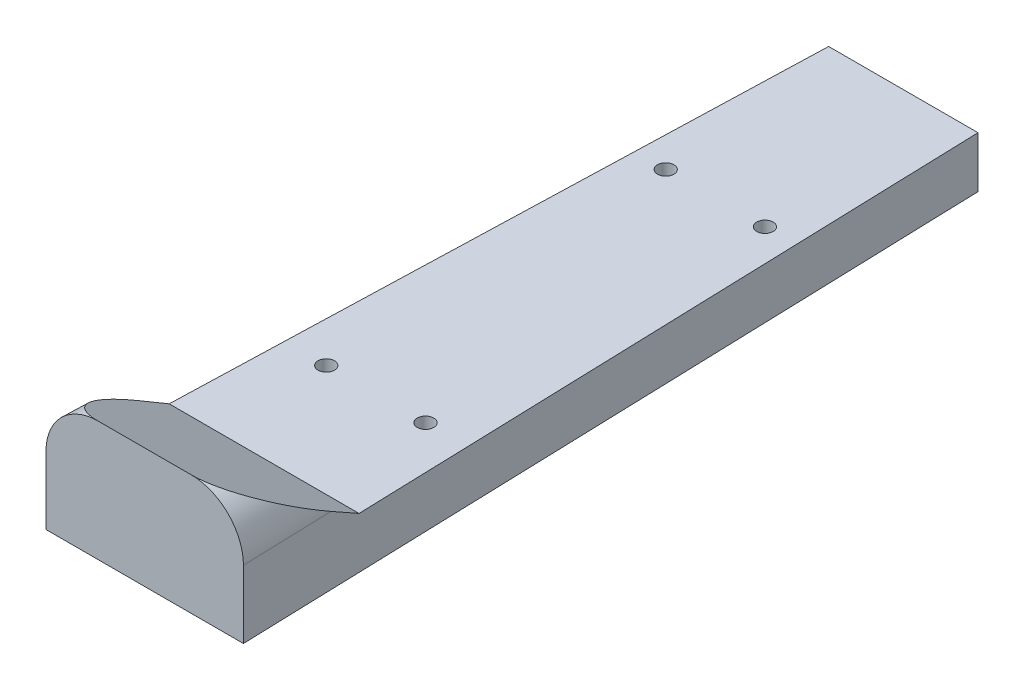
ISO-10303-21;
HEADER;
FILE_DESCRIPTION(('STEP AP214'),'2;1');
FILE_NAME('part.step','',(''),(''),'','','');
FILE_SCHEMA(('AUTOMOTIVE_DESIGN { 1 0 10303 214 1 1 1 1 }'));
ENDSEC;
DATA;
#1=APPLICATION_CONTEXT('core data for automotive mechanical design processes');
#2=APPLICATION_PROTOCOL_DEFINITION('international standard','automotive_design',2000,#1);
#3=PRODUCT_CONTEXT('',#1,'mechanical');
#4=PRODUCT('Part','Part','',(#3));
#5=PRODUCT_RELATED_PRODUCT_CATEGORY('part','',(#4));
#6=PRODUCT_DEFINITION_FORMATION('','',#4);
#7=PRODUCT_DEFINITION_CONTEXT('part definition',#1,'design');
#8=PRODUCT_DEFINITION('design','',#6,#7);
#9=PRODUCT_DEFINITION_SHAPE('','',#8);
#10=(LENGTH_UNIT() NAMED_UNIT(*) SI_UNIT(.MILLI.,.METRE.));
#11=(NAMED_UNIT(*) PLANE_ANGLE_UNIT() SI_UNIT($,.RADIAN.));
#12=(NAMED_UNIT(*) SI_UNIT($,.STERADIAN.) SOLID_ANGLE_UNIT());
#13=UNCERTAINTY_MEASURE_WITH_UNIT(LENGTH_MEASURE(1.E-05),#10,'distance_accuracy_value','');
#14=(GEOMETRIC_REPRESENTATION_CONTEXT(3) GLOBAL_UNCERTAINTY_ASSIGNED_CONTEXT((#13)) GLOBAL_UNIT_ASSIGNED_CONTEXT((#10,
#11,#12)) REPRESENTATION_CONTEXT('',''));
#15=CARTESIAN_POINT('',(0.,0.,0.));
#16=DIRECTION('',(0.,0.,1.));
#17=DIRECTION('',(1.,0.,0.));
#18=AXIS2_PLACEMENT_3D('',#15,#16,#17);
#19=CARTESIAN_POINT('',(0.,20.723241317766,0.));
#20=DIRECTION('',(0.,1.,0.));
#21=DIRECTION('',(0.,0.,1.));
#22=AXIS2_PLACEMENT_3D('',#19,#20,#21);
#23=PLANE('',#22);
#24=CARTESIAN_POINT('',(-12.065,20.723241317766,-1311.9354));
#25=DIRECTION('',(0.,1.,0.));
#26=DIRECTION('',(0.,0.,1.));
#27=AXIS2_PLACEMENT_3D('',#24,#25,#26);
#28=CIRCLE('',#27,2.);
#29=CARTESIAN_POINT('',(-12.065,20.723241317766,-1309.9354));
#30=VERTEX_POINT('',#29);
#31=EDGE_CURVE('E152',#30,#30,#28,.F.);
#32=ORIENTED_EDGE('',*,*,#31,.F.);
#33=EDGE_LOOP('',(#32));
#34=FACE_BOUND('',#33,.T.);
#35=CARTESIAN_POINT('',(-12.065,20.723241317766,-1229.3854));
#36=DIRECTION('',(0.,1.,0.));
#37=DIRECTION('',(0.,0.,1.));
#38=AXIS2_PLACEMENT_3D('',#35,#36,#37);
#39=CIRCLE('',#38,2.);
#40=CARTESIAN_POINT('',(-12.065,20.723241317766,-1227.3854));
#41=VERTEX_POINT('',#40);
#42=EDGE_CURVE('E148',#41,#41,#39,.F.);
#43=ORIENTED_EDGE('',*,*,#42,.F.);
#44=EDGE_LOOP('',(#43));
#45=FACE_BOUND('',#44,.T.);
#46=CARTESIAN_POINT('',(12.065,20.723241317766,-1311.9354));
#47=DIRECTION('',(0.,1.,0.));
#48=DIRECTION('',(0.,0.,1.));
#49=AXIS2_PLACEMENT_3D('',#46,#47,#48);
#50=CIRCLE('',#49,2.);
#51=CARTESIAN_POINT('',(12.065,20.723241317766,-1309.9354));
#52=VERTEX_POINT('',#51);
#53=EDGE_CURVE('E145',#52,#52,#50,.F.);
#54=ORIENTED_EDGE('',*,*,#53,.F.);
#55=EDGE_LOOP('',(#54));
#56=FACE_BOUND('',#55,.T.);
#57=CARTESIAN_POINT('',(12.065,20.723241317766,-1229.3854));
#58=DIRECTION('',(0.,1.,0.));
#59=DIRECTION('',(0.,0.,1.));
#60=AXIS2_PLACEMENT_3D('',#57,#58,#59);
#61=CIRCLE('',#60,2.);
#62=CARTESIAN_POINT('',(12.065,20.723241317766,-1227.3854));
#63=VERTEX_POINT('',#62);
#64=EDGE_CURVE('E164',#63,#63,#61,.F.);
#65=ORIENTED_EDGE('',*,*,#64,.F.);
#66=EDGE_LOOP('',(#65));
#67=FACE_BOUND('',#66,.T.);
#68=DIRECTION('',(-1.,0.,0.));
#69=VECTOR('',#68,1.);
#70=CARTESIAN_POINT('',(0.,20.723241317766,-1173.17130026192));
#71=LINE('',#70,#69);
#72=CARTESIAN_POINT('',(24.0069483527925,20.723241317766,-1173.17130026192));
#73=VERTEX_POINT('',#72);
#74=CARTESIAN_POINT('',(-24.0069483527925,20.723241317766,-1173.17130026192));
#75=VERTEX_POINT('',#74);
#76=EDGE_CURVE('E11',#73,#75,#71,.T.);
#77=ORIENTED_EDGE('',*,*,#76,.T.);
#78=DIRECTION('',(-0.0316721902279268,0.,0.999498310336824));
#79=VECTOR('',#78,1.);
#80=CARTESIAN_POINT('',(-61.1211296763861,20.723241317766,-1.93681172447797));
#81=LINE('',#80,#79);
#82=CARTESIAN_POINT('',(-18.161,20.723241317766,-1357.6554));
#83=VERTEX_POINT('',#82);
#84=EDGE_CURVE('E149',#83,#75,#81,.T.);
#85=ORIENTED_EDGE('',*,*,#84,.F.);
#86=DIRECTION('',(-1.,0.,0.));
#87=VECTOR('',#86,1.);
#88=CARTESIAN_POINT('',(0.,20.723241317766,-1357.6554));
#89=LINE('',#88,#87);
#90=CARTESIAN_POINT('',(18.161,20.723241317766,-1357.6554));
#91=VERTEX_POINT('',#90);
#92=EDGE_CURVE('E53',#91,#83,#89,.T.);
#93=ORIENTED_EDGE('',*,*,#92,.F.);
#94=DIRECTION('',(-0.0316721902279269,0.,-0.999498310336824));
#95=VECTOR('',#94,1.);
#96=CARTESIAN_POINT('',(61.1211296763861,20.723241317766,-1.93681172447798));
#97=LINE('',#96,#95);
#98=EDGE_CURVE('E59',#73,#91,#97,.T.);
#99=ORIENTED_EDGE('',*,*,#98,.F.);
#100=EDGE_LOOP('',(#77,#85,#93,#99));
#101=FACE_BOUND('',#100,.T.);
#102=ADVANCED_FACE('F45',(#34,#45,#56,#67,#101),#23,.F.);
#103=CARTESIAN_POINT('',(48.4275011351085,37.211,-1.5345749085833));
#104=DIRECTION('',(0.0316721902279269,0.,0.999498310336824));
#105=DIRECTION('',(0.999498310336824,0.,-0.0316721902279269));
#106=AXIS2_PLACEMENT_3D('',#103,#104,#105);
#107=CYLINDRICAL_SURFACE('',#106,12.7);
#108=CARTESIAN_POINT('',(10.6035293942455,37.211,-1195.16834551804));
#109=DIRECTION('',(0.,-0.866025403784437,0.500000000000002));
#110=DIRECTION('',(0.0365657822610186,0.49966562408466,0.865446247710236));
#111=AXIS2_PLACEMENT_3D('',#108,#109,#110);
#112=ELLIPSE('',#111,25.4127493136434,12.7);
#113=CARTESIAN_POINT('',(11.3005736959707,49.911,-1173.17130026192));
#114=VERTEX_POINT('',#113);
#115=CARTESIAN_POINT('',(23.3099040510673,37.211,-1195.16834551804));
#116=VERTEX_POINT('',#115);
#117=EDGE_CURVE('E225',#114,#116,#112,.F.);
#118=ORIENTED_EDGE('',*,*,#117,.F.);
#119=CARTESIAN_POINT('',(11.3005736959708,37.211,-1173.17130026192));
#120=DIRECTION('',(0.,0.,1.));
#121=DIRECTION('',(1.,0.,0.));
#122=AXIS2_PLACEMENT_3D('',#119,#120,#121);
#123=ELLIPSE('',#122,12.7063746568218,12.7);
#124=CARTESIAN_POINT('',(24.0069483527925,37.211,-1173.17130026192));
#125=VERTEX_POINT('',#124);
#126=EDGE_CURVE('E122',#114,#125,#123,.F.);
#127=ORIENTED_EDGE('',*,*,#126,.T.);
#128=DIRECTION('',(0.0316721902279269,0.,0.999498310336824));
#129=VECTOR('',#128,1.);
#130=CARTESIAN_POINT('',(61.1211296763861,37.211,-1.93681172447798));
#131=LINE('',#130,#129);
#132=EDGE_CURVE('E139',#116,#125,#131,.T.);
#133=ORIENTED_EDGE('',*,*,#132,.F.);
#134=EDGE_LOOP('',(#118,#127,#133));
#135=FACE_BOUND('',#134,.T.);
#136=ADVANCED_FACE('F176',(#135),#107,.T.);
#137=CARTESIAN_POINT('',(-127.,33.147,-1367.43782063533));
#138=DIRECTION('',(0.,-1.,0.));
#139=DIRECTION('',(0.,0.,-1.));
#140=AXIS2_PLACEMENT_3D('',#137,#138,#139);
#141=PLANE('',#140);
#142=CARTESIAN_POINT('',(12.065,33.147,-1311.9354));
#143=DIRECTION('',(0.,1.,0.));
#144=DIRECTION('',(0.,0.,-1.));
#145=AXIS2_PLACEMENT_3D('',#142,#143,#144);
#146=CIRCLE('',#145,2.);
#147=CARTESIAN_POINT('',(12.065,33.147,-1313.9354));
#148=VERTEX_POINT('',#147);
#149=EDGE_CURVE('E338',#148,#148,#146,.T.);
#150=ORIENTED_EDGE('',*,*,#149,.F.);
#151=EDGE_LOOP('',(#150));
#152=FACE_BOUND('',#151,.T.);
#153=CARTESIAN_POINT('',(-12.065,33.147,-1229.3854));
#154=DIRECTION('',(0.,1.,0.));
#155=DIRECTION('',(0.,0.,1.));
#156=AXIS2_PLACEMENT_3D('',#153,#154,#155);
#157=CIRCLE('',#156,2.);
#158=CARTESIAN_POINT('',(-12.065,33.147,-1227.3854));
#159=VERTEX_POINT('',#158);
#160=EDGE_CURVE('E336',#159,#159,#157,.T.);
#161=ORIENTED_EDGE('',*,*,#160,.F.);
#162=EDGE_LOOP('',(#161));
#163=FACE_BOUND('',#162,.T.);
#164=CARTESIAN_POINT('',(12.065,33.147,-1229.3854));
#165=DIRECTION('',(0.,1.,0.));
#166=DIRECTION('',(0.,0.,-1.));
#167=AXIS2_PLACEMENT_3D('',#164,#165,#166);
#168=CIRCLE('',#167,2.);
#169=CARTESIAN_POINT('',(12.065,33.147,-1231.3854));
#170=VERTEX_POINT('',#169);
#171=EDGE_CURVE('E339',#170,#170,#168,.T.);
#172=ORIENTED_EDGE('',*,*,#171,.F.);
#173=EDGE_LOOP('',(#172));
#174=FACE_BOUND('',#173,.T.);
#175=CARTESIAN_POINT('',(-12.065,33.147,-1311.9354));
#176=DIRECTION('',(0.,1.,0.));
#177=DIRECTION('',(0.,0.,1.));
#178=AXIS2_PLACEMENT_3D('',#175,#176,#177);
#179=CIRCLE('',#178,2.);
#180=CARTESIAN_POINT('',(-12.065,33.147,-1309.9354));
#181=VERTEX_POINT('',#180);
#182=EDGE_CURVE('E342',#181,#181,#179,.T.);
#183=ORIENTED_EDGE('',*,*,#182,.F.);
#184=EDGE_LOOP('',(#183));
#185=FACE_BOUND('',#184,.T.);
#186=DIRECTION('',(1.,0.,0.));
#187=VECTOR('',#186,1.);
#188=CARTESIAN_POINT('',(0.,33.147,-1357.6554));
#189=LINE('',#188,#187);
#190=CARTESIAN_POINT('',(-18.161,33.147,-1357.6554));
#191=VERTEX_POINT('',#190);
#192=CARTESIAN_POINT('',(18.161,33.147,-1357.6554));
#193=VERTEX_POINT('',#192);
#194=EDGE_CURVE('E229',#191,#193,#189,.T.);
#195=ORIENTED_EDGE('',*,*,#194,.F.);
#196=DIRECTION('',(0.0316721902279268,0.,-0.999498310336824));
#197=VECTOR('',#196,1.);
#198=CARTESIAN_POINT('',(-61.1211296763861,33.1469999999998,-1.93681172447797));
#199=LINE('',#198,#197);
#200=CARTESIAN_POINT('',(-23.0868498745152,33.147,-1202.2074));
#201=VERTEX_POINT('',#200);
#202=EDGE_CURVE('E113',#201,#191,#199,.T.);
#203=ORIENTED_EDGE('',*,*,#202,.F.);
#204=DIRECTION('',(1.,0.,0.));
#205=VECTOR('',#204,1.);
#206=CARTESIAN_POINT('',(-127.,33.147,-1202.2074));
#207=LINE('',#206,#205);
#208=CARTESIAN_POINT('',(23.0868498745152,33.147,-1202.2074));
#209=VERTEX_POINT('',#208);
#210=EDGE_CURVE('E231',#201,#209,#207,.T.);
#211=ORIENTED_EDGE('',*,*,#210,.T.);
#212=DIRECTION('',(0.0316721902279269,0.,0.999498310336824));
#213=VECTOR('',#212,1.);
#214=CARTESIAN_POINT('',(61.1211296763861,33.1469999999998,-1.93681172447797));
#215=LINE('',#214,#213);
#216=EDGE_CURVE('E134',#193,#209,#215,.T.);
#217=ORIENTED_EDGE('',*,*,#216,.F.);
#218=EDGE_LOOP('',(#195,#203,#211,#217));
#219=FACE_BOUND('',#218,.T.);
#220=ADVANCED_FACE('F215',(#152,#163,#174,#185,#219),#141,.F.);
#221=CARTESIAN_POINT('',(12.065,-8.46454236446797,-1311.9354));
#222=DIRECTION('',(0.,1.,0.));
#223=DIRECTION('',(0.,0.,1.));
#224=AXIS2_PLACEMENT_3D('',#221,#222,#223);
#225=CYLINDRICAL_SURFACE('',#224,2.);
#226=ORIENTED_EDGE('',*,*,#53,.T.);
#227=EDGE_LOOP('',(#226));
#228=FACE_BOUND('',#227,.T.);
#229=ORIENTED_EDGE('',*,*,#149,.T.);
#230=EDGE_LOOP('',(#229));
#231=FACE_BOUND('',#230,.T.);
#232=ADVANCED_FACE('F221',(#228,#231),#225,.F.);
#233=CARTESIAN_POINT('',(-12.065,-8.46454236446798,-1229.3854));
#234=DIRECTION('',(0.,1.,0.));
#235=DIRECTION('',(0.,0.,1.));
#236=AXIS2_PLACEMENT_3D('',#233,#234,#235);
#237=CYLINDRICAL_SURFACE('',#236,2.);
#238=ORIENTED_EDGE('',*,*,#42,.T.);
#239=EDGE_LOOP('',(#238));
#240=FACE_BOUND('',#239,.T.);
#241=ORIENTED_EDGE('',*,*,#160,.T.);
#242=EDGE_LOOP('',(#241));
#243=FACE_BOUND('',#242,.T.);
#244=ADVANCED_FACE('F292',(#240,#243),#237,.F.);
#245=CARTESIAN_POINT('',(12.065,-8.46454236446798,-1229.3854));
#246=DIRECTION('',(0.,1.,0.));
#247=DIRECTION('',(0.,0.,1.));
#248=AXIS2_PLACEMENT_3D('',#245,#246,#247);
#249=CYLINDRICAL_SURFACE('',#248,2.);
#250=ORIENTED_EDGE('',*,*,#64,.T.);
#251=EDGE_LOOP('',(#250));
#252=FACE_BOUND('',#251,.T.);
#253=ORIENTED_EDGE('',*,*,#171,.T.);
#254=EDGE_LOOP('',(#253));
#255=FACE_BOUND('',#254,.T.);
#256=ADVANCED_FACE('F288',(#252,#255),#249,.F.);
#257=CARTESIAN_POINT('',(-12.065,-8.46454236446797,-1311.9354));
#258=DIRECTION('',(0.,1.,0.));
#259=DIRECTION('',(0.,0.,1.));
#260=AXIS2_PLACEMENT_3D('',#257,#258,#259);
#261=CYLINDRICAL_SURFACE('',#260,2.);
#262=ORIENTED_EDGE('',*,*,#31,.T.);
#263=EDGE_LOOP('',(#262));
#264=FACE_BOUND('',#263,.T.);
#265=ORIENTED_EDGE('',*,*,#182,.T.);
#266=EDGE_LOOP('',(#265));
#267=FACE_BOUND('',#266,.T.);
#268=ADVANCED_FACE('F171',(#264,#267),#261,.F.);
#269=CARTESIAN_POINT('',(-127.,33.147,-1202.2074));
#270=DIRECTION('',(0.,-0.866025403784437,0.500000000000002));
#271=DIRECTION('',(0.,-0.500000000000002,-0.866025403784437));
#272=AXIS2_PLACEMENT_3D('',#269,#270,#271);
#273=PLANE('',#272);
#274=ORIENTED_EDGE('',*,*,#210,.F.);
#275=DIRECTION('',(0.0274323613165251,-0.499811830980572,-0.865699485482374));
#276=VECTOR('',#275,1.);
#277=CARTESIAN_POINT('',(-51.1652361142519,544.729268676541,-316.120918400885));
#278=LINE('',#277,#276);
#279=CARTESIAN_POINT('',(-23.3099040510673,37.211,-1195.16834551804));
#280=VERTEX_POINT('',#279);
#281=EDGE_CURVE('E109',#280,#201,#278,.T.);
#282=ORIENTED_EDGE('',*,*,#281,.F.);
#283=CARTESIAN_POINT('',(-10.6035293942455,37.211,-1195.16834551804));
#284=DIRECTION('',(0.,-0.866025403784437,0.500000000000002));
#285=DIRECTION('',(-0.0365657822610185,0.49966562408466,0.865446247710236));
#286=AXIS2_PLACEMENT_3D('',#283,#284,#285);
#287=ELLIPSE('',#286,25.4127493136434,12.7);
#288=CARTESIAN_POINT('',(-11.3005736959707,49.911,-1173.17130026192));
#289=VERTEX_POINT('',#288);
#290=EDGE_CURVE('E101',#280,#289,#287,.F.);
#291=ORIENTED_EDGE('',*,*,#290,.T.);
#292=DIRECTION('',(-1.,0.,0.));
#293=VECTOR('',#292,1.);
#294=CARTESIAN_POINT('',(-49.911,49.911,-1173.17130026192));
#295=LINE('',#294,#293);
#296=EDGE_CURVE('E106',#114,#289,#295,.T.);
#297=ORIENTED_EDGE('',*,*,#296,.F.);
#298=ORIENTED_EDGE('',*,*,#117,.T.);
#299=DIRECTION('',(0.0274323613165252,0.499811830980572,0.865699485482374));
#300=VECTOR('',#299,1.);
#301=CARTESIAN_POINT('',(51.1652361142519,544.729268676541,-316.120918400885));
#302=LINE('',#301,#300);
#303=EDGE_CURVE('E227',#209,#116,#302,.T.);
#304=ORIENTED_EDGE('',*,*,#303,.F.);
#305=EDGE_LOOP('',(#274,#282,#291,#297,#298,#304));
#306=FACE_BOUND('',#305,.T.);
#307=ADVANCED_FACE('F104',(#306),#273,.F.);
#308=CARTESIAN_POINT('',(-49.2816382741247,37.211,25.4199432696363));
#309=DIRECTION('',(-0.0316721902279268,0.,0.999498310336824));
#310=DIRECTION('',(0.999498310336824,0.,0.0316721902279268));
#311=AXIS2_PLACEMENT_3D('',#308,#309,#310);
#312=CYLINDRICAL_SURFACE('',#311,12.7);
#313=ORIENTED_EDGE('',*,*,#290,.F.);
#314=DIRECTION('',(-0.0316721902279268,0.,0.999498310336824));
#315=VECTOR('',#314,1.);
#316=CARTESIAN_POINT('',(-61.1211296763861,37.211,-1.93681172447797));
#317=LINE('',#316,#315);
#318=CARTESIAN_POINT('',(-24.0069483527925,37.211,-1173.17130026192));
#319=VERTEX_POINT('',#318);
#320=EDGE_CURVE('E118',#319,#280,#317,.F.);
#321=ORIENTED_EDGE('',*,*,#320,.F.);
#322=CARTESIAN_POINT('',(-11.3005736959707,37.211,-1173.17130026192));
#323=DIRECTION('',(0.,0.,1.));
#324=DIRECTION('',(-1.,0.,0.));
#325=AXIS2_PLACEMENT_3D('',#322,#323,#324);
#326=ELLIPSE('',#325,12.7063746568218,12.7);
#327=EDGE_CURVE('E116',#319,#289,#326,.F.);
#328=ORIENTED_EDGE('',*,*,#327,.T.);
#329=EDGE_LOOP('',(#313,#321,#328));
#330=FACE_BOUND('',#329,.T.);
#331=ADVANCED_FACE('F117',(#330),#312,.T.);
#332=CARTESIAN_POINT('',(0.,0.,-1173.17130026192));
#333=DIRECTION('',(0.,0.,1.));
#334=DIRECTION('',(1.,0.,0.));
#335=AXIS2_PLACEMENT_3D('',#332,#333,#334);
#336=PLANE('',#335);
#337=ORIENTED_EDGE('',*,*,#76,.F.);
#338=DIRECTION('',(0.,1.,0.));
#339=VECTOR('',#338,1.);
#340=CARTESIAN_POINT('',(24.0069483527925,0.,-1173.17130026192));
#341=LINE('',#340,#339);
#342=EDGE_CURVE('E127',#73,#125,#341,.T.);
#343=ORIENTED_EDGE('',*,*,#342,.T.);
#344=ORIENTED_EDGE('',*,*,#126,.F.);
#345=ORIENTED_EDGE('',*,*,#296,.T.);
#346=ORIENTED_EDGE('',*,*,#327,.F.);
#347=DIRECTION('',(0.,-1.,0.));
#348=VECTOR('',#347,1.);
#349=CARTESIAN_POINT('',(-24.0069483527925,0.,-1173.17130026192));
#350=LINE('',#349,#348);
#351=EDGE_CURVE('E129',#319,#75,#350,.T.);
#352=ORIENTED_EDGE('',*,*,#351,.T.);
#353=EDGE_LOOP('',(#337,#343,#344,#345,#346,#352));
#354=FACE_BOUND('',#353,.T.);
#355=ADVANCED_FACE('F125',(#354),#336,.T.);
#356=CARTESIAN_POINT('',(0.,0.,-1357.6554));
#357=DIRECTION('',(0.,0.,1.));
#358=DIRECTION('',(1.,0.,0.));
#359=AXIS2_PLACEMENT_3D('',#356,#357,#358);
#360=PLANE('',#359);
#361=CARTESIAN_POINT('',(18.161,20.723241317766,-1357.6554));
#362=DIRECTION('',(0.,1.,0.));
#363=VECTOR('',#362,1.);
#364=LINE('',#361,#363);
#365=EDGE_CURVE('E192',#91,#193,#364,.T.);
#366=ORIENTED_EDGE('',*,*,#365,.F.);
#367=ORIENTED_EDGE('',*,*,#92,.T.);
#368=CARTESIAN_POINT('',(-18.161,33.147,-1357.6554));
#369=DIRECTION('',(0.,-1.,0.));
#370=VECTOR('',#369,1.);
#371=LINE('',#368,#370);
#372=EDGE_CURVE('E114',#191,#83,#371,.T.);
#373=ORIENTED_EDGE('',*,*,#372,.F.);
#374=ORIENTED_EDGE('',*,*,#194,.T.);
#375=EDGE_LOOP('',(#366,#367,#373,#374));
#376=FACE_BOUND('',#375,.T.);
#377=ADVANCED_FACE('F210',(#376),#360,.F.);
#378=CARTESIAN_POINT('',(-61.1211296763861,0.,-1.93681172447797));
#379=DIRECTION('',(0.999498310336824,0.,0.0316721902279268));
#380=DIRECTION('',(0.0316721902279268,0.,-0.999498310336824));
#381=AXIS2_PLACEMENT_3D('',#378,#379,#380);
#382=PLANE('',#381);
#383=ORIENTED_EDGE('',*,*,#372,.T.);
#384=ORIENTED_EDGE('',*,*,#84,.T.);
#385=ORIENTED_EDGE('',*,*,#351,.F.);
#386=ORIENTED_EDGE('',*,*,#320,.T.);
#387=ORIENTED_EDGE('',*,*,#281,.T.);
#388=ORIENTED_EDGE('',*,*,#202,.T.);
#389=EDGE_LOOP('',(#383,#384,#385,#386,#387,#388));
#390=FACE_BOUND('',#389,.T.);
#391=ADVANCED_FACE('F185',(#390),#382,.F.);
#392=CARTESIAN_POINT('',(61.1211296763861,0.,-1.93681172447798));
#393=DIRECTION('',(-0.999498310336824,0.,0.0316721902279269));
#394=DIRECTION('',(0.0316721902279269,0.,0.999498310336824));
#395=AXIS2_PLACEMENT_3D('',#392,#393,#394);
#396=PLANE('',#395);
#397=ORIENTED_EDGE('',*,*,#342,.F.);
#398=ORIENTED_EDGE('',*,*,#98,.T.);
#399=ORIENTED_EDGE('',*,*,#365,.T.);
#400=ORIENTED_EDGE('',*,*,#216,.T.);
#401=ORIENTED_EDGE('',*,*,#303,.T.);
#402=ORIENTED_EDGE('',*,*,#132,.T.);
#403=EDGE_LOOP('',(#397,#398,#399,#400,#401,#402));
#404=FACE_BOUND('',#403,.T.);
#405=ADVANCED_FACE('F177',(#404),#396,.F.);
#406=CLOSED_SHELL('',(#102,#136,#220,#232,#244,#256,#268,#307,#331,#355,#377,#391,#405));
#407=MANIFOLD_SOLID_BREP('B2',#406);
#408=ADVANCED_BREP_SHAPE_REPRESENTATION('',(#18,#407),#14);
#409=SHAPE_DEFINITION_REPRESENTATION(#9,#408);
ENDSEC;
END-ISO-10303-21;
